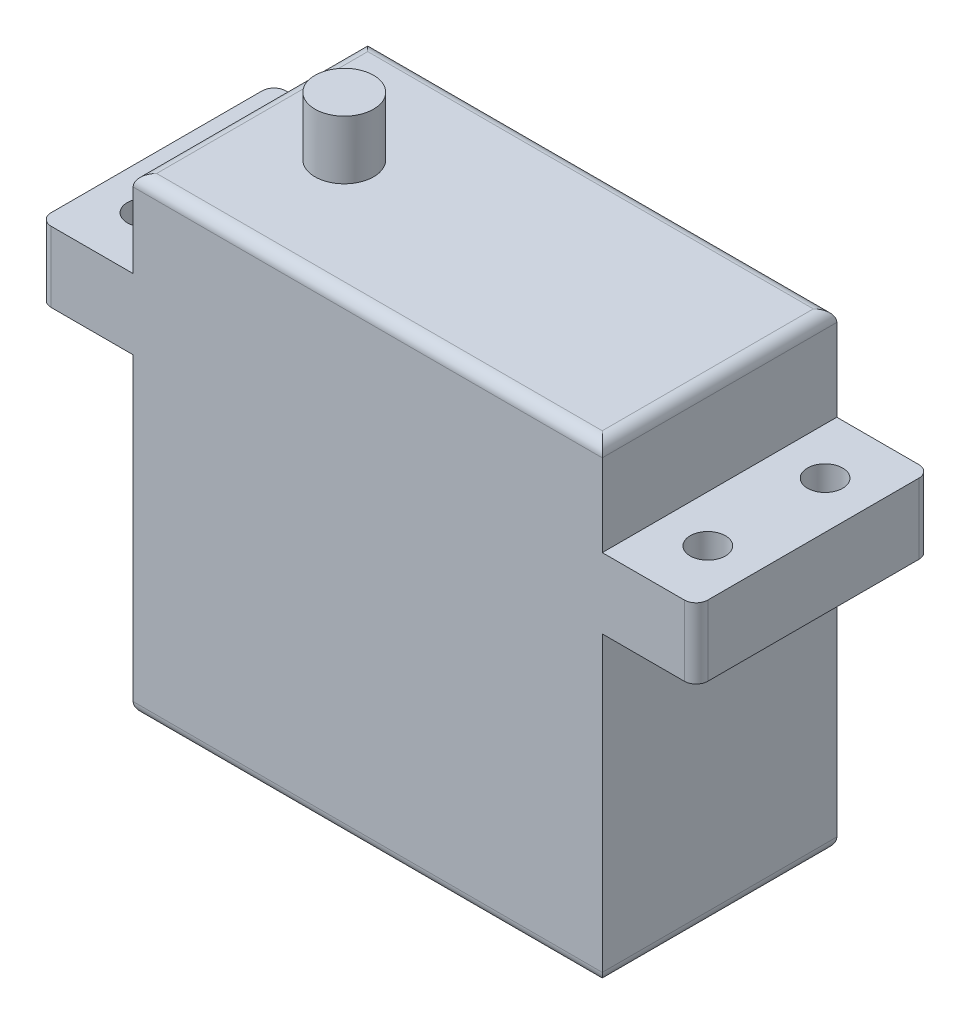
ISO-10303-21;
HEADER;
FILE_DESCRIPTION(('STEP AP214'),'2;1');
FILE_NAME('part.step','',(''),(''),'','','');
FILE_SCHEMA(('AUTOMOTIVE_DESIGN { 1 0 10303 214 1 1 1 1 }'));
ENDSEC;
DATA;
#1=APPLICATION_CONTEXT('core data for automotive mechanical design processes');
#2=APPLICATION_PROTOCOL_DEFINITION('international standard','automotive_design',2000,#1);
#3=PRODUCT_CONTEXT('',#1,'mechanical');
#4=PRODUCT('Part','Part','',(#3));
#5=PRODUCT_RELATED_PRODUCT_CATEGORY('part','',(#4));
#6=PRODUCT_DEFINITION_FORMATION('','',#4);
#7=PRODUCT_DEFINITION_CONTEXT('part definition',#1,'design');
#8=PRODUCT_DEFINITION('design','',#6,#7);
#9=PRODUCT_DEFINITION_SHAPE('','',#8);
#10=(LENGTH_UNIT() NAMED_UNIT(*) SI_UNIT(.MILLI.,.METRE.));
#11=(NAMED_UNIT(*) PLANE_ANGLE_UNIT() SI_UNIT($,.RADIAN.));
#12=(NAMED_UNIT(*) SI_UNIT($,.STERADIAN.) SOLID_ANGLE_UNIT());
#13=UNCERTAINTY_MEASURE_WITH_UNIT(LENGTH_MEASURE(1.E-05),#10,'distance_accuracy_value','');
#14=(GEOMETRIC_REPRESENTATION_CONTEXT(3) GLOBAL_UNCERTAINTY_ASSIGNED_CONTEXT((#13)) GLOBAL_UNIT_ASSIGNED_CONTEXT((#10,
#11,#12)) REPRESENTATION_CONTEXT('',''));
#15=CARTESIAN_POINT('',(0.,0.,0.));
#16=DIRECTION('',(0.,0.,1.));
#17=DIRECTION('',(1.,0.,0.));
#18=AXIS2_PLACEMENT_3D('',#15,#16,#17);
#19=CARTESIAN_POINT('',(-27.,0.,1.));
#20=DIRECTION('',(0.,-1.,0.));
#21=DIRECTION('',(1.,0.,0.));
#22=AXIS2_PLACEMENT_3D('',#19,#20,#21);
#23=CYLINDRICAL_SURFACE('',#22,1.);
#24=DIRECTION('',(0.,1.,0.));
#25=VECTOR('',#24,1.);
#26=CARTESIAN_POINT('',(-27.,0.,0.));
#27=LINE('',#26,#25);
#28=CARTESIAN_POINT('',(-27.,6.60422946958976,0.));
#29=VERTEX_POINT('',#28);
#30=CARTESIAN_POINT('',(-27.,12.6042294695898,0.));
#31=VERTEX_POINT('',#30);
#32=EDGE_CURVE('E322',#29,#31,#27,.T.);
#33=ORIENTED_EDGE('',*,*,#32,.F.);
#34=CARTESIAN_POINT('',(-27.,6.60422946958976,1.));
#35=DIRECTION('',(0.,1.,0.));
#36=DIRECTION('',(-1.,0.,0.));
#37=AXIS2_PLACEMENT_3D('',#34,#35,#36);
#38=CIRCLE('',#37,1.);
#39=CARTESIAN_POINT('',(-28.,6.60422946958976,1.));
#40=VERTEX_POINT('',#39);
#41=EDGE_CURVE('E328',#40,#29,#38,.F.);
#42=ORIENTED_EDGE('',*,*,#41,.F.);
#43=DIRECTION('',(0.,1.,0.));
#44=VECTOR('',#43,1.);
#45=CARTESIAN_POINT('',(-28.,0.,1.));
#46=LINE('',#45,#44);
#47=CARTESIAN_POINT('',(-28.,12.6042294695898,1.));
#48=VERTEX_POINT('',#47);
#49=EDGE_CURVE('E325',#48,#40,#46,.F.);
#50=ORIENTED_EDGE('',*,*,#49,.F.);
#51=CARTESIAN_POINT('',(-27.,12.6042294695898,1.));
#52=DIRECTION('',(0.,-1.,0.));
#53=DIRECTION('',(1.,0.,0.));
#54=AXIS2_PLACEMENT_3D('',#51,#52,#53);
#55=CIRCLE('',#54,1.);
#56=EDGE_CURVE('E330',#31,#48,#55,.F.);
#57=ORIENTED_EDGE('',*,*,#56,.F.);
#58=EDGE_LOOP('',(#33,#42,#50,#57));
#59=FACE_BOUND('',#58,.T.);
#60=ADVANCED_FACE('F40',(#59),#23,.T.);
#61=CARTESIAN_POINT('',(27.,0.,19.));
#62=DIRECTION('',(0.,-1.,0.));
#63=DIRECTION('',(0.,0.,-1.));
#64=AXIS2_PLACEMENT_3D('',#61,#62,#63);
#65=CYLINDRICAL_SURFACE('',#64,1.);
#66=DIRECTION('',(0.,-1.,0.));
#67=VECTOR('',#66,1.);
#68=CARTESIAN_POINT('',(28.,0.,19.));
#69=LINE('',#68,#67);
#70=CARTESIAN_POINT('',(28.,12.,19.));
#71=VERTEX_POINT('',#70);
#72=CARTESIAN_POINT('',(28.,6.,19.));
#73=VERTEX_POINT('',#72);
#74=EDGE_CURVE('E302',#71,#73,#69,.T.);
#75=ORIENTED_EDGE('',*,*,#74,.F.);
#76=CARTESIAN_POINT('',(27.,12.,19.));
#77=DIRECTION('',(0.,-1.,0.));
#78=DIRECTION('',(1.,0.,0.));
#79=AXIS2_PLACEMENT_3D('',#76,#77,#78);
#80=CIRCLE('',#79,1.);
#81=CARTESIAN_POINT('',(27.,12.,20.));
#82=VERTEX_POINT('',#81);
#83=EDGE_CURVE('E317',#82,#71,#80,.F.);
#84=ORIENTED_EDGE('',*,*,#83,.F.);
#85=DIRECTION('',(0.,-1.,0.));
#86=VECTOR('',#85,1.);
#87=CARTESIAN_POINT('',(27.,0.,20.));
#88=LINE('',#87,#86);
#89=CARTESIAN_POINT('',(27.,6.,20.));
#90=VERTEX_POINT('',#89);
#91=EDGE_CURVE('E314',#90,#82,#88,.F.);
#92=ORIENTED_EDGE('',*,*,#91,.F.);
#93=CARTESIAN_POINT('',(27.,6.,19.));
#94=DIRECTION('',(0.,1.,0.));
#95=DIRECTION('',(-1.,0.,0.));
#96=AXIS2_PLACEMENT_3D('',#93,#94,#95);
#97=CIRCLE('',#96,1.);
#98=EDGE_CURVE('E320',#73,#90,#97,.F.);
#99=ORIENTED_EDGE('',*,*,#98,.F.);
#100=EDGE_LOOP('',(#75,#84,#92,#99));
#101=FACE_BOUND('',#100,.T.);
#102=ADVANCED_FACE('F396',(#101),#65,.T.);
#103=CARTESIAN_POINT('',(-20.,20.,20.));
#104=DIRECTION('',(1.,0.,0.));
#105=DIRECTION('',(0.,1.,0.));
#106=AXIS2_PLACEMENT_3D('',#103,#104,#105);
#107=PLANE('',#106);
#108=DIRECTION('',(0.,-1.,0.));
#109=VECTOR('',#108,1.);
#110=CARTESIAN_POINT('',(-20.,20.,20.));
#111=LINE('',#110,#109);
#112=CARTESIAN_POINT('',(-20.,19.,20.));
#113=VERTEX_POINT('',#112);
#114=CARTESIAN_POINT('',(-20.,12.6042294695898,20.));
#115=VERTEX_POINT('',#114);
#116=EDGE_CURVE('E192',#113,#115,#111,.T.);
#117=ORIENTED_EDGE('',*,*,#116,.F.);
#118=DIRECTION('',(0.,0.,-1.));
#119=VECTOR('',#118,1.);
#120=CARTESIAN_POINT('',(-20.,19.,20.));
#121=LINE('',#120,#119);
#122=CARTESIAN_POINT('',(-20.,19.,0.));
#123=VERTEX_POINT('',#122);
#124=EDGE_CURVE('E268',#113,#123,#121,.T.);
#125=ORIENTED_EDGE('',*,*,#124,.T.);
#126=DIRECTION('',(0.,-1.,0.));
#127=VECTOR('',#126,1.);
#128=CARTESIAN_POINT('',(-20.,20.,0.));
#129=LINE('',#128,#127);
#130=CARTESIAN_POINT('',(-20.,12.6042294695898,0.));
#131=VERTEX_POINT('',#130);
#132=EDGE_CURVE('E243',#123,#131,#129,.T.);
#133=ORIENTED_EDGE('',*,*,#132,.T.);
#134=DIRECTION('',(0.,0.,-1.));
#135=VECTOR('',#134,1.);
#136=CARTESIAN_POINT('',(-20.,12.6042294695898,0.));
#137=LINE('',#136,#135);
#138=EDGE_CURVE('E197',#115,#131,#137,.T.);
#139=ORIENTED_EDGE('',*,*,#138,.F.);
#140=EDGE_LOOP('',(#117,#125,#133,#139));
#141=FACE_BOUND('',#140,.T.);
#142=ADVANCED_FACE('F402',(#141),#107,.F.);
#143=CARTESIAN_POINT('',(-20.,6.60422946958976,0.));
#144=VERTEX_POINT('',#143);
#145=CARTESIAN_POINT('',(-20.,-19.,0.));
#146=VERTEX_POINT('',#145);
#147=EDGE_CURVE('E242',#144,#146,#129,.T.);
#148=ORIENTED_EDGE('',*,*,#147,.T.);
#149=DIRECTION('',(0.,0.,-1.));
#150=VECTOR('',#149,1.);
#151=CARTESIAN_POINT('',(-20.,-19.,20.));
#152=LINE('',#151,#150);
#153=CARTESIAN_POINT('',(-20.,-19.,20.));
#154=VERTEX_POINT('',#153);
#155=EDGE_CURVE('E191',#146,#154,#152,.F.);
#156=ORIENTED_EDGE('',*,*,#155,.T.);
#157=CARTESIAN_POINT('',(-20.,6.60422946958976,20.));
#158=VERTEX_POINT('',#157);
#159=EDGE_CURVE('E176',#158,#154,#111,.T.);
#160=ORIENTED_EDGE('',*,*,#159,.F.);
#161=DIRECTION('',(0.,0.,1.));
#162=VECTOR('',#161,1.);
#163=CARTESIAN_POINT('',(-20.,6.60422946958976,0.));
#164=LINE('',#163,#162);
#165=EDGE_CURVE('E188',#144,#158,#164,.T.);
#166=ORIENTED_EDGE('',*,*,#165,.F.);
#167=EDGE_LOOP('',(#148,#156,#160,#166));
#168=FACE_BOUND('',#167,.T.);
#169=ADVANCED_FACE('F187',(#168),#107,.F.);
#170=CARTESIAN_POINT('',(20.,20.,20.));
#171=DIRECTION('',(-1.,0.,0.));
#172=DIRECTION('',(0.,-1.,0.));
#173=AXIS2_PLACEMENT_3D('',#170,#171,#172);
#174=PLANE('',#173);
#175=DIRECTION('',(0.,1.,0.));
#176=VECTOR('',#175,1.);
#177=CARTESIAN_POINT('',(20.,20.,0.));
#178=LINE('',#177,#176);
#179=CARTESIAN_POINT('',(20.,12.,0.));
#180=VERTEX_POINT('',#179);
#181=CARTESIAN_POINT('',(20.,19.,0.));
#182=VERTEX_POINT('',#181);
#183=EDGE_CURVE('E233',#180,#182,#178,.T.);
#184=ORIENTED_EDGE('',*,*,#183,.T.);
#185=DIRECTION('',(0.,0.,-1.));
#186=VECTOR('',#185,1.);
#187=CARTESIAN_POINT('',(20.,19.,20.));
#188=LINE('',#187,#186);
#189=CARTESIAN_POINT('',(20.,19.,20.));
#190=VERTEX_POINT('',#189);
#191=EDGE_CURVE('E265',#182,#190,#188,.F.);
#192=ORIENTED_EDGE('',*,*,#191,.T.);
#193=DIRECTION('',(0.,1.,0.));
#194=VECTOR('',#193,1.);
#195=CARTESIAN_POINT('',(20.,20.,20.));
#196=LINE('',#195,#194);
#197=CARTESIAN_POINT('',(20.,12.,20.));
#198=VERTEX_POINT('',#197);
#199=EDGE_CURVE('E235',#198,#190,#196,.T.);
#200=ORIENTED_EDGE('',*,*,#199,.F.);
#201=DIRECTION('',(0.,0.,1.));
#202=VECTOR('',#201,1.);
#203=CARTESIAN_POINT('',(20.,12.,20.));
#204=LINE('',#203,#202);
#205=EDGE_CURVE('E219',#180,#198,#204,.T.);
#206=ORIENTED_EDGE('',*,*,#205,.F.);
#207=EDGE_LOOP('',(#184,#192,#200,#206));
#208=FACE_BOUND('',#207,.T.);
#209=ADVANCED_FACE('F470',(#208),#174,.F.);
#210=CARTESIAN_POINT('',(20.,-19.,20.));
#211=VERTEX_POINT('',#210);
#212=CARTESIAN_POINT('',(20.,6.,20.));
#213=VERTEX_POINT('',#212);
#214=EDGE_CURVE('E193',#211,#213,#196,.T.);
#215=ORIENTED_EDGE('',*,*,#214,.F.);
#216=DIRECTION('',(0.,0.,-1.));
#217=VECTOR('',#216,1.);
#218=CARTESIAN_POINT('',(20.,-19.,20.));
#219=LINE('',#218,#217);
#220=CARTESIAN_POINT('',(20.,-19.,0.));
#221=VERTEX_POINT('',#220);
#222=EDGE_CURVE('E298',#211,#221,#219,.T.);
#223=ORIENTED_EDGE('',*,*,#222,.T.);
#224=CARTESIAN_POINT('',(20.,6.,0.));
#225=VERTEX_POINT('',#224);
#226=EDGE_CURVE('E239',#221,#225,#178,.T.);
#227=ORIENTED_EDGE('',*,*,#226,.T.);
#228=DIRECTION('',(0.,0.,-1.));
#229=VECTOR('',#228,1.);
#230=CARTESIAN_POINT('',(20.,6.,20.));
#231=LINE('',#230,#229);
#232=EDGE_CURVE('E214',#213,#225,#231,.T.);
#233=ORIENTED_EDGE('',*,*,#232,.F.);
#234=EDGE_LOOP('',(#215,#223,#227,#233));
#235=FACE_BOUND('',#234,.T.);
#236=ADVANCED_FACE('F434',(#235),#174,.F.);
#237=CARTESIAN_POINT('',(-20.,20.,20.));
#238=DIRECTION('',(0.,-1.,0.));
#239=DIRECTION('',(0.,0.,-1.));
#240=AXIS2_PLACEMENT_3D('',#237,#238,#239);
#241=PLANE('',#240);
#242=DIRECTION('',(0.,0.,-1.));
#243=VECTOR('',#242,1.);
#244=CARTESIAN_POINT('',(19.,20.,20.));
#245=LINE('',#244,#243);
#246=CARTESIAN_POINT('',(19.,20.,19.));
#247=VERTEX_POINT('',#246);
#248=CARTESIAN_POINT('',(19.,20.,1.));
#249=VERTEX_POINT('',#248);
#250=EDGE_CURVE('E260',#247,#249,#245,.T.);
#251=ORIENTED_EDGE('',*,*,#250,.T.);
#252=DIRECTION('',(-1.,0.,0.));
#253=VECTOR('',#252,1.);
#254=CARTESIAN_POINT('',(-20.,20.,1.));
#255=LINE('',#254,#253);
#256=CARTESIAN_POINT('',(-19.,20.,1.));
#257=VERTEX_POINT('',#256);
#258=EDGE_CURVE('E263',#249,#257,#255,.T.);
#259=ORIENTED_EDGE('',*,*,#258,.T.);
#260=DIRECTION('',(0.,0.,-1.));
#261=VECTOR('',#260,1.);
#262=CARTESIAN_POINT('',(-19.,20.,20.));
#263=LINE('',#262,#261);
#264=CARTESIAN_POINT('',(-19.,20.,19.));
#265=VERTEX_POINT('',#264);
#266=EDGE_CURVE('E258',#257,#265,#263,.F.);
#267=ORIENTED_EDGE('',*,*,#266,.T.);
#268=DIRECTION('',(-1.,0.,0.));
#269=VECTOR('',#268,1.);
#270=CARTESIAN_POINT('',(20.,20.,19.));
#271=LINE('',#270,#269);
#272=EDGE_CURVE('E248',#265,#247,#271,.F.);
#273=ORIENTED_EDGE('',*,*,#272,.T.);
#274=EDGE_LOOP('',(#251,#259,#267,#273));
#275=FACE_BOUND('',#274,.T.);
#276=CARTESIAN_POINT('',(-12.,20.,10.));
#277=DIRECTION('',(0.,-1.,0.));
#278=DIRECTION('',(0.,0.,-1.));
#279=AXIS2_PLACEMENT_3D('',#276,#277,#278);
#280=CIRCLE('',#279,2.5);
#281=CARTESIAN_POINT('',(-12.,20.,7.5));
#282=VERTEX_POINT('',#281);
#283=EDGE_CURVE('E238',#282,#282,#280,.F.);
#284=ORIENTED_EDGE('',*,*,#283,.F.);
#285=EDGE_LOOP('',(#284));
#286=FACE_BOUND('',#285,.T.);
#287=ADVANCED_FACE('F456',(#275,#286),#241,.F.);
#288=CARTESIAN_POINT('',(-20.,-20.,20.));
#289=DIRECTION('',(0.,1.,0.));
#290=DIRECTION('',(0.,0.,1.));
#291=AXIS2_PLACEMENT_3D('',#288,#289,#290);
#292=PLANE('',#291);
#293=DIRECTION('',(1.,0.,0.));
#294=VECTOR('',#293,1.);
#295=CARTESIAN_POINT('',(-20.,-20.,19.));
#296=LINE('',#295,#294);
#297=CARTESIAN_POINT('',(19.,-20.,19.));
#298=VERTEX_POINT('',#297);
#299=CARTESIAN_POINT('',(-19.,-20.,19.));
#300=VERTEX_POINT('',#299);
#301=EDGE_CURVE('E290',#298,#300,#296,.F.);
#302=ORIENTED_EDGE('',*,*,#301,.T.);
#303=DIRECTION('',(0.,0.,-1.));
#304=VECTOR('',#303,1.);
#305=CARTESIAN_POINT('',(-19.,-20.,20.));
#306=LINE('',#305,#304);
#307=CARTESIAN_POINT('',(-19.,-20.,1.));
#308=VERTEX_POINT('',#307);
#309=EDGE_CURVE('E292',#300,#308,#306,.T.);
#310=ORIENTED_EDGE('',*,*,#309,.T.);
#311=DIRECTION('',(1.,0.,0.));
#312=VECTOR('',#311,1.);
#313=CARTESIAN_POINT('',(-20.,-20.,1.));
#314=LINE('',#313,#312);
#315=CARTESIAN_POINT('',(19.,-20.,1.));
#316=VERTEX_POINT('',#315);
#317=EDGE_CURVE('E274',#308,#316,#314,.T.);
#318=ORIENTED_EDGE('',*,*,#317,.T.);
#319=DIRECTION('',(0.,0.,-1.));
#320=VECTOR('',#319,1.);
#321=CARTESIAN_POINT('',(19.,-20.,20.));
#322=LINE('',#321,#320);
#323=EDGE_CURVE('E288',#316,#298,#322,.F.);
#324=ORIENTED_EDGE('',*,*,#323,.T.);
#325=EDGE_LOOP('',(#302,#310,#318,#324));
#326=FACE_BOUND('',#325,.T.);
#327=ADVANCED_FACE('F454',(#326),#292,.F.);
#328=CARTESIAN_POINT('',(0.,0.,20.));
#329=DIRECTION('',(0.,0.,1.));
#330=DIRECTION('',(1.,0.,0.));
#331=AXIS2_PLACEMENT_3D('',#328,#329,#330);
#332=PLANE('',#331);
#333=DIRECTION('',(1.,0.,0.));
#334=VECTOR('',#333,1.);
#335=CARTESIAN_POINT('',(-28.,12.6042294695898,20.));
#336=LINE('',#335,#334);
#337=CARTESIAN_POINT('',(-27.,12.6042294695898,20.));
#338=VERTEX_POINT('',#337);
#339=EDGE_CURVE('E181',#338,#115,#336,.T.);
#340=ORIENTED_EDGE('',*,*,#339,.F.);
#341=DIRECTION('',(0.,1.,0.));
#342=VECTOR('',#341,1.);
#343=CARTESIAN_POINT('',(-27.,0.,20.));
#344=LINE('',#343,#342);
#345=CARTESIAN_POINT('',(-27.,6.60422946958976,20.));
#346=VERTEX_POINT('',#345);
#347=EDGE_CURVE('E48',#338,#346,#344,.F.);
#348=ORIENTED_EDGE('',*,*,#347,.T.);
#349=DIRECTION('',(1.,0.,0.));
#350=VECTOR('',#349,1.);
#351=CARTESIAN_POINT('',(-28.,6.60422946958976,20.));
#352=LINE('',#351,#350);
#353=EDGE_CURVE('E173',#346,#158,#352,.T.);
#354=ORIENTED_EDGE('',*,*,#353,.T.);
#355=ORIENTED_EDGE('',*,*,#159,.T.);
#356=DIRECTION('',(1.,0.,0.));
#357=VECTOR('',#356,1.);
#358=CARTESIAN_POINT('',(20.,-19.,20.));
#359=LINE('',#358,#357);
#360=EDGE_CURVE('E296',#154,#211,#359,.T.);
#361=ORIENTED_EDGE('',*,*,#360,.T.);
#362=ORIENTED_EDGE('',*,*,#214,.T.);
#363=DIRECTION('',(-1.,0.,0.));
#364=VECTOR('',#363,1.);
#365=CARTESIAN_POINT('',(28.,6.,20.));
#366=LINE('',#365,#364);
#367=EDGE_CURVE('E231',#90,#213,#366,.T.);
#368=ORIENTED_EDGE('',*,*,#367,.F.);
#369=ORIENTED_EDGE('',*,*,#91,.T.);
#370=DIRECTION('',(-1.,0.,0.));
#371=VECTOR('',#370,1.);
#372=CARTESIAN_POINT('',(28.,12.,20.));
#373=LINE('',#372,#371);
#374=EDGE_CURVE('E221',#82,#198,#373,.T.);
#375=ORIENTED_EDGE('',*,*,#374,.T.);
#376=ORIENTED_EDGE('',*,*,#199,.T.);
#377=DIRECTION('',(-1.,0.,0.));
#378=VECTOR('',#377,1.);
#379=CARTESIAN_POINT('',(-20.,19.,20.));
#380=LINE('',#379,#378);
#381=EDGE_CURVE('E272',#190,#113,#380,.T.);
#382=ORIENTED_EDGE('',*,*,#381,.T.);
#383=ORIENTED_EDGE('',*,*,#116,.T.);
#384=EDGE_LOOP('',(#340,#348,#354,#355,#361,#362,#368,#369,#375,#376,#382,#383));
#385=FACE_BOUND('',#384,.T.);
#386=ADVANCED_FACE('F175',(#385),#332,.T.);
#387=CARTESIAN_POINT('',(0.,0.,0.));
#388=DIRECTION('',(0.,0.,1.));
#389=DIRECTION('',(1.,0.,0.));
#390=AXIS2_PLACEMENT_3D('',#387,#388,#389);
#391=PLANE('',#390);
#392=DIRECTION('',(-1.,0.,0.));
#393=VECTOR('',#392,1.);
#394=CARTESIAN_POINT('',(28.,12.,0.));
#395=LINE('',#394,#393);
#396=CARTESIAN_POINT('',(27.,12.,0.));
#397=VERTEX_POINT('',#396);
#398=EDGE_CURVE('E227',#397,#180,#395,.T.);
#399=ORIENTED_EDGE('',*,*,#398,.F.);
#400=DIRECTION('',(0.,1.,0.));
#401=VECTOR('',#400,1.);
#402=CARTESIAN_POINT('',(27.,6.,0.));
#403=LINE('',#402,#401);
#404=CARTESIAN_POINT('',(27.,6.,0.));
#405=VERTEX_POINT('',#404);
#406=EDGE_CURVE('E338',#397,#405,#403,.F.);
#407=ORIENTED_EDGE('',*,*,#406,.T.);
#408=DIRECTION('',(-1.,0.,0.));
#409=VECTOR('',#408,1.);
#410=CARTESIAN_POINT('',(28.,6.,0.));
#411=LINE('',#410,#409);
#412=EDGE_CURVE('E229',#405,#225,#411,.T.);
#413=ORIENTED_EDGE('',*,*,#412,.T.);
#414=ORIENTED_EDGE('',*,*,#226,.F.);
#415=DIRECTION('',(1.,0.,0.));
#416=VECTOR('',#415,1.);
#417=CARTESIAN_POINT('',(0.,-19.,0.));
#418=LINE('',#417,#416);
#419=EDGE_CURVE('E300',#221,#146,#418,.F.);
#420=ORIENTED_EDGE('',*,*,#419,.T.);
#421=ORIENTED_EDGE('',*,*,#147,.F.);
#422=DIRECTION('',(1.,0.,0.));
#423=VECTOR('',#422,1.);
#424=CARTESIAN_POINT('',(-28.,6.60422946958976,0.));
#425=LINE('',#424,#423);
#426=EDGE_CURVE('E180',#29,#144,#425,.T.);
#427=ORIENTED_EDGE('',*,*,#426,.F.);
#428=ORIENTED_EDGE('',*,*,#32,.T.);
#429=DIRECTION('',(1.,0.,0.));
#430=VECTOR('',#429,1.);
#431=CARTESIAN_POINT('',(-28.,12.6042294695898,0.));
#432=LINE('',#431,#430);
#433=EDGE_CURVE('E210',#31,#131,#432,.T.);
#434=ORIENTED_EDGE('',*,*,#433,.T.);
#435=ORIENTED_EDGE('',*,*,#132,.F.);
#436=DIRECTION('',(-1.,0.,0.));
#437=VECTOR('',#436,1.);
#438=CARTESIAN_POINT('',(0.,19.,0.));
#439=LINE('',#438,#437);
#440=EDGE_CURVE('E270',#123,#182,#439,.F.);
#441=ORIENTED_EDGE('',*,*,#440,.T.);
#442=ORIENTED_EDGE('',*,*,#183,.F.);
#443=EDGE_LOOP('',(#399,#407,#413,#414,#420,#421,#427,#428,#434,#435,#441,#442));
#444=FACE_BOUND('',#443,.T.);
#445=ADVANCED_FACE('F439',(#444),#391,.F.);
#446=CARTESIAN_POINT('',(28.,6.,20.));
#447=DIRECTION('',(0.,1.,0.));
#448=DIRECTION('',(-1.,0.,0.));
#449=AXIS2_PLACEMENT_3D('',#446,#447,#448);
#450=PLANE('',#449);
#451=CARTESIAN_POINT('',(24.,6.,5.00000000000001));
#452=DIRECTION('',(0.,1.,0.));
#453=DIRECTION('',(-1.,0.,0.));
#454=AXIS2_PLACEMENT_3D('',#451,#452,#453);
#455=CIRCLE('',#454,1.5);
#456=CARTESIAN_POINT('',(22.5,6.,5.00000000000001));
#457=VERTEX_POINT('',#456);
#458=EDGE_CURVE('E204',#457,#457,#455,.T.);
#459=ORIENTED_EDGE('',*,*,#458,.T.);
#460=EDGE_LOOP('',(#459));
#461=FACE_BOUND('',#460,.T.);
#462=CARTESIAN_POINT('',(24.,6.,15.));
#463=DIRECTION('',(0.,1.,0.));
#464=DIRECTION('',(-1.,0.,0.));
#465=AXIS2_PLACEMENT_3D('',#462,#463,#464);
#466=CIRCLE('',#465,1.5);
#467=CARTESIAN_POINT('',(22.5,6.,15.));
#468=VERTEX_POINT('',#467);
#469=EDGE_CURVE('E252',#468,#468,#466,.T.);
#470=ORIENTED_EDGE('',*,*,#469,.T.);
#471=EDGE_LOOP('',(#470));
#472=FACE_BOUND('',#471,.T.);
#473=ORIENTED_EDGE('',*,*,#412,.F.);
#474=CARTESIAN_POINT('',(27.,6.,1.));
#475=DIRECTION('',(0.,1.,0.));
#476=DIRECTION('',(-1.,0.,0.));
#477=AXIS2_PLACEMENT_3D('',#474,#475,#476);
#478=CIRCLE('',#477,1.);
#479=CARTESIAN_POINT('',(28.,6.,1.));
#480=VERTEX_POINT('',#479);
#481=EDGE_CURVE('E340',#405,#480,#478,.F.);
#482=ORIENTED_EDGE('',*,*,#481,.T.);
#483=DIRECTION('',(0.,0.,-1.));
#484=VECTOR('',#483,1.);
#485=CARTESIAN_POINT('',(28.,6.,20.));
#486=LINE('',#485,#484);
#487=EDGE_CURVE('E215',#73,#480,#486,.T.);
#488=ORIENTED_EDGE('',*,*,#487,.F.);
#489=ORIENTED_EDGE('',*,*,#98,.T.);
#490=ORIENTED_EDGE('',*,*,#367,.T.);
#491=ORIENTED_EDGE('',*,*,#232,.T.);
#492=EDGE_LOOP('',(#473,#482,#488,#489,#490,#491));
#493=FACE_BOUND('',#492,.T.);
#494=ADVANCED_FACE('F424',(#461,#472,#493),#450,.F.);
#495=CARTESIAN_POINT('',(28.,12.,20.));
#496=DIRECTION('',(0.,-1.,0.));
#497=DIRECTION('',(1.,0.,0.));
#498=AXIS2_PLACEMENT_3D('',#495,#496,#497);
#499=PLANE('',#498);
#500=CARTESIAN_POINT('',(24.,12.,5.00000000000001));
#501=DIRECTION('',(0.,-1.,0.));
#502=DIRECTION('',(1.,0.,0.));
#503=AXIS2_PLACEMENT_3D('',#500,#501,#502);
#504=CIRCLE('',#503,1.5);
#505=CARTESIAN_POINT('',(25.5,12.,5.00000000000001));
#506=VERTEX_POINT('',#505);
#507=EDGE_CURVE('E254',#506,#506,#504,.T.);
#508=ORIENTED_EDGE('',*,*,#507,.T.);
#509=EDGE_LOOP('',(#508));
#510=FACE_BOUND('',#509,.T.);
#511=CARTESIAN_POINT('',(24.,12.,15.));
#512=DIRECTION('',(0.,-1.,0.));
#513=DIRECTION('',(1.,0.,0.));
#514=AXIS2_PLACEMENT_3D('',#511,#512,#513);
#515=CIRCLE('',#514,1.5);
#516=CARTESIAN_POINT('',(25.5,12.,15.));
#517=VERTEX_POINT('',#516);
#518=EDGE_CURVE('E249',#517,#517,#515,.T.);
#519=ORIENTED_EDGE('',*,*,#518,.T.);
#520=EDGE_LOOP('',(#519));
#521=FACE_BOUND('',#520,.T.);
#522=DIRECTION('',(0.,0.,1.));
#523=VECTOR('',#522,1.);
#524=CARTESIAN_POINT('',(28.,12.,20.));
#525=LINE('',#524,#523);
#526=CARTESIAN_POINT('',(28.,12.,1.));
#527=VERTEX_POINT('',#526);
#528=EDGE_CURVE('E218',#527,#71,#525,.T.);
#529=ORIENTED_EDGE('',*,*,#528,.F.);
#530=CARTESIAN_POINT('',(27.,12.,1.));
#531=DIRECTION('',(0.,-1.,0.));
#532=DIRECTION('',(1.,0.,0.));
#533=AXIS2_PLACEMENT_3D('',#530,#531,#532);
#534=CIRCLE('',#533,1.);
#535=EDGE_CURVE('E336',#527,#397,#534,.F.);
#536=ORIENTED_EDGE('',*,*,#535,.T.);
#537=ORIENTED_EDGE('',*,*,#398,.T.);
#538=ORIENTED_EDGE('',*,*,#205,.T.);
#539=ORIENTED_EDGE('',*,*,#374,.F.);
#540=ORIENTED_EDGE('',*,*,#83,.T.);
#541=EDGE_LOOP('',(#529,#536,#537,#538,#539,#540));
#542=FACE_BOUND('',#541,.T.);
#543=ADVANCED_FACE('F392',(#510,#521,#542),#499,.F.);
#544=CARTESIAN_POINT('',(28.,0.,0.));
#545=DIRECTION('',(1.,0.,0.));
#546=DIRECTION('',(0.,0.,-1.));
#547=AXIS2_PLACEMENT_3D('',#544,#545,#546);
#548=PLANE('',#547);
#549=ORIENTED_EDGE('',*,*,#487,.T.);
#550=DIRECTION('',(0.,1.,0.));
#551=VECTOR('',#550,1.);
#552=CARTESIAN_POINT('',(28.,12.,1.));
#553=LINE('',#552,#551);
#554=EDGE_CURVE('E333',#480,#527,#553,.T.);
#555=ORIENTED_EDGE('',*,*,#554,.T.);
#556=ORIENTED_EDGE('',*,*,#528,.T.);
#557=ORIENTED_EDGE('',*,*,#74,.T.);
#558=EDGE_LOOP('',(#549,#555,#556,#557));
#559=FACE_BOUND('',#558,.T.);
#560=ADVANCED_FACE('F386',(#559),#548,.T.);
#561=CARTESIAN_POINT('',(-28.,6.60422946958976,0.));
#562=DIRECTION('',(0.,1.,0.));
#563=DIRECTION('',(-1.,0.,0.));
#564=AXIS2_PLACEMENT_3D('',#561,#562,#563);
#565=PLANE('',#564);
#566=CARTESIAN_POINT('',(-24.,6.60422946958976,15.));
#567=DIRECTION('',(0.,1.,0.));
#568=DIRECTION('',(-1.,0.,0.));
#569=AXIS2_PLACEMENT_3D('',#566,#567,#568);
#570=CIRCLE('',#569,1.5);
#571=CARTESIAN_POINT('',(-25.5,6.60422946958976,15.));
#572=VERTEX_POINT('',#571);
#573=EDGE_CURVE('E253',#572,#572,#570,.T.);
#574=ORIENTED_EDGE('',*,*,#573,.T.);
#575=EDGE_LOOP('',(#574));
#576=FACE_BOUND('',#575,.T.);
#577=CARTESIAN_POINT('',(-24.,6.60422946958976,5.));
#578=DIRECTION('',(0.,1.,0.));
#579=DIRECTION('',(-1.,0.,0.));
#580=AXIS2_PLACEMENT_3D('',#577,#578,#579);
#581=CIRCLE('',#580,1.5);
#582=CARTESIAN_POINT('',(-25.5,6.60422946958976,5.));
#583=VERTEX_POINT('',#582);
#584=EDGE_CURVE('E361',#583,#583,#581,.T.);
#585=ORIENTED_EDGE('',*,*,#584,.T.);
#586=EDGE_LOOP('',(#585));
#587=FACE_BOUND('',#586,.T.);
#588=ORIENTED_EDGE('',*,*,#353,.F.);
#589=CARTESIAN_POINT('',(-27.,6.60422946958976,19.));
#590=DIRECTION('',(0.,1.,0.));
#591=DIRECTION('',(-1.,0.,0.));
#592=AXIS2_PLACEMENT_3D('',#589,#590,#591);
#593=CIRCLE('',#592,1.);
#594=CARTESIAN_POINT('',(-28.,6.60422946958976,19.));
#595=VERTEX_POINT('',#594);
#596=EDGE_CURVE('E11',#346,#595,#593,.F.);
#597=ORIENTED_EDGE('',*,*,#596,.T.);
#598=DIRECTION('',(0.,0.,1.));
#599=VECTOR('',#598,1.);
#600=CARTESIAN_POINT('',(-28.,6.60422946958976,0.));
#601=LINE('',#600,#599);
#602=EDGE_CURVE('E201',#40,#595,#601,.T.);
#603=ORIENTED_EDGE('',*,*,#602,.F.);
#604=ORIENTED_EDGE('',*,*,#41,.T.);
#605=ORIENTED_EDGE('',*,*,#426,.T.);
#606=ORIENTED_EDGE('',*,*,#165,.T.);
#607=EDGE_LOOP('',(#588,#597,#603,#604,#605,#606));
#608=FACE_BOUND('',#607,.T.);
#609=ADVANCED_FACE('F195',(#576,#587,#608),#565,.F.);
#610=CARTESIAN_POINT('',(-28.,12.6042294695898,0.));
#611=DIRECTION('',(0.,-1.,0.));
#612=DIRECTION('',(1.,0.,0.));
#613=AXIS2_PLACEMENT_3D('',#610,#611,#612);
#614=PLANE('',#613);
#615=CARTESIAN_POINT('',(-24.,12.6042294695898,15.));
#616=DIRECTION('',(0.,1.,0.));
#617=DIRECTION('',(-1.,0.,0.));
#618=AXIS2_PLACEMENT_3D('',#615,#616,#617);
#619=CIRCLE('',#618,1.5);
#620=CARTESIAN_POINT('',(-25.5,12.6042294695898,15.));
#621=VERTEX_POINT('',#620);
#622=EDGE_CURVE('E286',#621,#621,#619,.T.);
#623=ORIENTED_EDGE('',*,*,#622,.F.);
#624=EDGE_LOOP('',(#623));
#625=FACE_BOUND('',#624,.T.);
#626=CARTESIAN_POINT('',(-24.,12.6042294695898,5.));
#627=DIRECTION('',(0.,1.,0.));
#628=DIRECTION('',(-1.,0.,0.));
#629=AXIS2_PLACEMENT_3D('',#626,#627,#628);
#630=CIRCLE('',#629,1.5);
#631=CARTESIAN_POINT('',(-25.5,12.6042294695898,5.));
#632=VERTEX_POINT('',#631);
#633=EDGE_CURVE('E364',#632,#632,#630,.T.);
#634=ORIENTED_EDGE('',*,*,#633,.F.);
#635=EDGE_LOOP('',(#634));
#636=FACE_BOUND('',#635,.T.);
#637=DIRECTION('',(0.,0.,-1.));
#638=VECTOR('',#637,1.);
#639=CARTESIAN_POINT('',(-28.,12.6042294695898,0.));
#640=LINE('',#639,#638);
#641=CARTESIAN_POINT('',(-28.,12.6042294695898,19.));
#642=VERTEX_POINT('',#641);
#643=EDGE_CURVE('E207',#642,#48,#640,.T.);
#644=ORIENTED_EDGE('',*,*,#643,.F.);
#645=CARTESIAN_POINT('',(-27.,12.6042294695898,19.));
#646=DIRECTION('',(0.,-1.,0.));
#647=DIRECTION('',(1.,0.,0.));
#648=AXIS2_PLACEMENT_3D('',#645,#646,#647);
#649=CIRCLE('',#648,1.);
#650=EDGE_CURVE('E62',#642,#338,#649,.F.);
#651=ORIENTED_EDGE('',*,*,#650,.T.);
#652=ORIENTED_EDGE('',*,*,#339,.T.);
#653=ORIENTED_EDGE('',*,*,#138,.T.);
#654=ORIENTED_EDGE('',*,*,#433,.F.);
#655=ORIENTED_EDGE('',*,*,#56,.T.);
#656=EDGE_LOOP('',(#644,#651,#652,#653,#654,#655));
#657=FACE_BOUND('',#656,.T.);
#658=ADVANCED_FACE('F351',(#625,#636,#657),#614,.F.);
#659=CARTESIAN_POINT('',(-28.,0.,0.));
#660=DIRECTION('',(-1.,0.,0.));
#661=DIRECTION('',(0.,-1.,0.));
#662=AXIS2_PLACEMENT_3D('',#659,#660,#661);
#663=PLANE('',#662);
#664=ORIENTED_EDGE('',*,*,#602,.T.);
#665=DIRECTION('',(0.,1.,0.));
#666=VECTOR('',#665,1.);
#667=CARTESIAN_POINT('',(-28.,0.,19.));
#668=LINE('',#667,#666);
#669=EDGE_CURVE('E342',#595,#642,#668,.T.);
#670=ORIENTED_EDGE('',*,*,#669,.T.);
#671=ORIENTED_EDGE('',*,*,#643,.T.);
#672=ORIENTED_EDGE('',*,*,#49,.T.);
#673=EDGE_LOOP('',(#664,#670,#671,#672));
#674=FACE_BOUND('',#673,.T.);
#675=ADVANCED_FACE('F348',(#674),#663,.T.);
#676=CARTESIAN_POINT('',(-12.,25.,10.));
#677=DIRECTION('',(0.,-1.,0.));
#678=DIRECTION('',(0.,0.,-1.));
#679=AXIS2_PLACEMENT_3D('',#676,#677,#678);
#680=CYLINDRICAL_SURFACE('',#679,2.5);
#681=CARTESIAN_POINT('',(-12.,25.,10.));
#682=DIRECTION('',(0.,1.,0.));
#683=DIRECTION('',(0.,0.,1.));
#684=AXIS2_PLACEMENT_3D('',#681,#682,#683);
#685=CIRCLE('',#684,2.5);
#686=CARTESIAN_POINT('',(-12.,25.,12.5));
#687=VERTEX_POINT('',#686);
#688=EDGE_CURVE('E198',#687,#687,#685,.T.);
#689=ORIENTED_EDGE('',*,*,#688,.F.);
#690=EDGE_LOOP('',(#689));
#691=FACE_BOUND('',#690,.T.);
#692=ORIENTED_EDGE('',*,*,#283,.T.);
#693=EDGE_LOOP('',(#692));
#694=FACE_BOUND('',#693,.T.);
#695=ADVANCED_FACE('F655',(#691,#694),#680,.T.);
#696=CARTESIAN_POINT('',(-12.,25.,10.));
#697=DIRECTION('',(0.,1.,0.));
#698=DIRECTION('',(0.,0.,1.));
#699=AXIS2_PLACEMENT_3D('',#696,#697,#698);
#700=PLANE('',#699);
#701=ORIENTED_EDGE('',*,*,#688,.T.);
#702=EDGE_LOOP('',(#701));
#703=FACE_BOUND('',#702,.T.);
#704=ADVANCED_FACE('F381',(#703),#700,.T.);
#705=CARTESIAN_POINT('',(-24.,-2.39577053041024,5.));
#706=DIRECTION('',(0.,1.,0.));
#707=DIRECTION('',(-1.,0.,0.));
#708=AXIS2_PLACEMENT_3D('',#705,#706,#707);
#709=CYLINDRICAL_SURFACE('',#708,1.5);
#710=ORIENTED_EDGE('',*,*,#633,.T.);
#711=EDGE_LOOP('',(#710));
#712=FACE_BOUND('',#711,.T.);
#713=ORIENTED_EDGE('',*,*,#584,.F.);
#714=EDGE_LOOP('',(#713));
#715=FACE_BOUND('',#714,.T.);
#716=ADVANCED_FACE('F378',(#712,#715),#709,.F.);
#717=CARTESIAN_POINT('',(-24.,-2.39577053041024,15.));
#718=DIRECTION('',(0.,1.,0.));
#719=DIRECTION('',(-1.,0.,0.));
#720=AXIS2_PLACEMENT_3D('',#717,#718,#719);
#721=CYLINDRICAL_SURFACE('',#720,1.5);
#722=ORIENTED_EDGE('',*,*,#622,.T.);
#723=EDGE_LOOP('',(#722));
#724=FACE_BOUND('',#723,.T.);
#725=ORIENTED_EDGE('',*,*,#573,.F.);
#726=EDGE_LOOP('',(#725));
#727=FACE_BOUND('',#726,.T.);
#728=ADVANCED_FACE('F370',(#724,#727),#721,.F.);
#729=CARTESIAN_POINT('',(24.,-2.39577053041023,15.));
#730=DIRECTION('',(0.,1.,0.));
#731=DIRECTION('',(-1.,0.,0.));
#732=AXIS2_PLACEMENT_3D('',#729,#730,#731);
#733=CYLINDRICAL_SURFACE('',#732,1.5);
#734=ORIENTED_EDGE('',*,*,#518,.F.);
#735=EDGE_LOOP('',(#734));
#736=FACE_BOUND('',#735,.T.);
#737=ORIENTED_EDGE('',*,*,#469,.F.);
#738=EDGE_LOOP('',(#737));
#739=FACE_BOUND('',#738,.T.);
#740=ADVANCED_FACE('F613',(#736,#739),#733,.F.);
#741=CARTESIAN_POINT('',(24.,-2.39577053041023,5.00000000000001));
#742=DIRECTION('',(0.,1.,0.));
#743=DIRECTION('',(-1.,0.,0.));
#744=AXIS2_PLACEMENT_3D('',#741,#742,#743);
#745=CYLINDRICAL_SURFACE('',#744,1.5);
#746=ORIENTED_EDGE('',*,*,#507,.F.);
#747=EDGE_LOOP('',(#746));
#748=FACE_BOUND('',#747,.T.);
#749=ORIENTED_EDGE('',*,*,#458,.F.);
#750=EDGE_LOOP('',(#749));
#751=FACE_BOUND('',#750,.T.);
#752=ADVANCED_FACE('F488',(#748,#751),#745,.F.);
#753=CARTESIAN_POINT('',(-19.,19.,20.));
#754=DIRECTION('',(0.,0.,-1.));
#755=DIRECTION('',(-1.,0.,0.));
#756=AXIS2_PLACEMENT_3D('',#753,#754,#755);
#757=CYLINDRICAL_SURFACE('',#756,1.);
#758=CARTESIAN_POINT('',(-19.,19.,1.));
#759=DIRECTION('',(-0.707106781186547,0.,0.707106781186547));
#760=DIRECTION('',(-0.707106781186547,0.,-0.707106781186547));
#761=AXIS2_PLACEMENT_3D('',#758,#759,#760);
#762=ELLIPSE('',#761,1.41421356237309,1.);
#763=EDGE_CURVE('E280',#123,#257,#762,.F.);
#764=ORIENTED_EDGE('',*,*,#763,.F.);
#765=ORIENTED_EDGE('',*,*,#124,.F.);
#766=CARTESIAN_POINT('',(-19.,19.,19.));
#767=DIRECTION('',(0.707106781186547,0.,0.707106781186547));
#768=DIRECTION('',(0.707106781186547,0.,-0.707106781186547));
#769=AXIS2_PLACEMENT_3D('',#766,#767,#768);
#770=ELLIPSE('',#769,1.41421356237309,1.);
#771=EDGE_CURVE('E283',#265,#113,#770,.T.);
#772=ORIENTED_EDGE('',*,*,#771,.F.);
#773=ORIENTED_EDGE('',*,*,#266,.F.);
#774=EDGE_LOOP('',(#764,#765,#772,#773));
#775=FACE_BOUND('',#774,.T.);
#776=ADVANCED_FACE('F485',(#775),#757,.T.);
#777=CARTESIAN_POINT('',(0.,19.,19.));
#778=DIRECTION('',(1.,0.,0.));
#779=DIRECTION('',(0.,0.,-1.));
#780=AXIS2_PLACEMENT_3D('',#777,#778,#779);
#781=CYLINDRICAL_SURFACE('',#780,1.);
#782=ORIENTED_EDGE('',*,*,#771,.T.);
#783=ORIENTED_EDGE('',*,*,#381,.F.);
#784=CARTESIAN_POINT('',(19.,19.,19.));
#785=DIRECTION('',(0.707106781186547,0.,-0.707106781186547));
#786=DIRECTION('',(0.707106781186547,0.,0.707106781186547));
#787=AXIS2_PLACEMENT_3D('',#784,#785,#786);
#788=ELLIPSE('',#787,1.41421356237309,1.);
#789=EDGE_CURVE('E277',#247,#190,#788,.T.);
#790=ORIENTED_EDGE('',*,*,#789,.F.);
#791=ORIENTED_EDGE('',*,*,#272,.F.);
#792=EDGE_LOOP('',(#782,#783,#790,#791));
#793=FACE_BOUND('',#792,.T.);
#794=ADVANCED_FACE('F481',(#793),#781,.T.);
#795=CARTESIAN_POINT('',(-20.,19.,1.));
#796=DIRECTION('',(-1.,0.,0.));
#797=DIRECTION('',(0.,0.,1.));
#798=AXIS2_PLACEMENT_3D('',#795,#796,#797);
#799=CYLINDRICAL_SURFACE('',#798,1.);
#800=ORIENTED_EDGE('',*,*,#763,.T.);
#801=ORIENTED_EDGE('',*,*,#258,.F.);
#802=CARTESIAN_POINT('',(19.,19.,1.));
#803=DIRECTION('',(-0.707106781186547,0.,-0.707106781186547));
#804=DIRECTION('',(-0.707106781186547,0.,0.707106781186547));
#805=AXIS2_PLACEMENT_3D('',#802,#803,#804);
#806=ELLIPSE('',#805,1.41421356237309,1.);
#807=EDGE_CURVE('E275',#182,#249,#806,.F.);
#808=ORIENTED_EDGE('',*,*,#807,.F.);
#809=ORIENTED_EDGE('',*,*,#440,.F.);
#810=EDGE_LOOP('',(#800,#801,#808,#809));
#811=FACE_BOUND('',#810,.T.);
#812=ADVANCED_FACE('F477',(#811),#799,.T.);
#813=CARTESIAN_POINT('',(19.,19.,20.));
#814=DIRECTION('',(0.,0.,-1.));
#815=DIRECTION('',(-1.,0.,0.));
#816=AXIS2_PLACEMENT_3D('',#813,#814,#815);
#817=CYLINDRICAL_SURFACE('',#816,1.);
#818=ORIENTED_EDGE('',*,*,#789,.T.);
#819=ORIENTED_EDGE('',*,*,#191,.F.);
#820=ORIENTED_EDGE('',*,*,#807,.T.);
#821=ORIENTED_EDGE('',*,*,#250,.F.);
#822=EDGE_LOOP('',(#818,#819,#820,#821));
#823=FACE_BOUND('',#822,.T.);
#824=ADVANCED_FACE('F474',(#823),#817,.T.);
#825=CARTESIAN_POINT('',(19.,-19.,20.));
#826=DIRECTION('',(0.,0.,-1.));
#827=DIRECTION('',(-1.,0.,0.));
#828=AXIS2_PLACEMENT_3D('',#825,#826,#827);
#829=CYLINDRICAL_SURFACE('',#828,1.);
#830=CARTESIAN_POINT('',(19.,-19.,1.));
#831=DIRECTION('',(0.707106781186547,0.,0.707106781186547));
#832=DIRECTION('',(0.707106781186547,0.,-0.707106781186547));
#833=AXIS2_PLACEMENT_3D('',#830,#831,#832);
#834=ELLIPSE('',#833,1.41421356237309,1.);
#835=EDGE_CURVE('E307',#221,#316,#834,.F.);
#836=ORIENTED_EDGE('',*,*,#835,.F.);
#837=ORIENTED_EDGE('',*,*,#222,.F.);
#838=CARTESIAN_POINT('',(19.,-19.,19.));
#839=DIRECTION('',(0.707106781186547,0.,-0.707106781186547));
#840=DIRECTION('',(-0.707106781186547,0.,-0.707106781186547));
#841=AXIS2_PLACEMENT_3D('',#838,#839,#840);
#842=ELLIPSE('',#841,1.41421356237309,1.);
#843=EDGE_CURVE('E278',#298,#211,#842,.F.);
#844=ORIENTED_EDGE('',*,*,#843,.F.);
#845=ORIENTED_EDGE('',*,*,#323,.F.);
#846=EDGE_LOOP('',(#836,#837,#844,#845));
#847=FACE_BOUND('',#846,.T.);
#848=ADVANCED_FACE('F443',(#847),#829,.T.);
#849=CARTESIAN_POINT('',(0.,-19.,19.));
#850=DIRECTION('',(-1.,0.,0.));
#851=DIRECTION('',(0.,0.,1.));
#852=AXIS2_PLACEMENT_3D('',#849,#850,#851);
#853=CYLINDRICAL_SURFACE('',#852,1.);
#854=ORIENTED_EDGE('',*,*,#843,.T.);
#855=ORIENTED_EDGE('',*,*,#360,.F.);
#856=CARTESIAN_POINT('',(-19.,-19.,19.));
#857=DIRECTION('',(-0.707106781186547,0.,-0.707106781186547));
#858=DIRECTION('',(-0.707106781186547,0.,0.707106781186547));
#859=AXIS2_PLACEMENT_3D('',#856,#857,#858);
#860=ELLIPSE('',#859,1.41421356237309,1.);
#861=EDGE_CURVE('E305',#300,#154,#860,.T.);
#862=ORIENTED_EDGE('',*,*,#861,.F.);
#863=ORIENTED_EDGE('',*,*,#301,.F.);
#864=EDGE_LOOP('',(#854,#855,#862,#863));
#865=FACE_BOUND('',#864,.T.);
#866=ADVANCED_FACE('F452',(#865),#853,.T.);
#867=CARTESIAN_POINT('',(-20.,-19.,1.));
#868=DIRECTION('',(1.,0.,0.));
#869=DIRECTION('',(0.,0.,-1.));
#870=AXIS2_PLACEMENT_3D('',#867,#868,#869);
#871=CYLINDRICAL_SURFACE('',#870,1.);
#872=ORIENTED_EDGE('',*,*,#835,.T.);
#873=ORIENTED_EDGE('',*,*,#317,.F.);
#874=CARTESIAN_POINT('',(-19.,-19.,1.));
#875=DIRECTION('',(0.707106781186547,0.,-0.707106781186547));
#876=DIRECTION('',(0.707106781186547,0.,0.707106781186547));
#877=AXIS2_PLACEMENT_3D('',#874,#875,#876);
#878=ELLIPSE('',#877,1.41421356237309,1.);
#879=EDGE_CURVE('E303',#146,#308,#878,.F.);
#880=ORIENTED_EDGE('',*,*,#879,.F.);
#881=ORIENTED_EDGE('',*,*,#419,.F.);
#882=EDGE_LOOP('',(#872,#873,#880,#881));
#883=FACE_BOUND('',#882,.T.);
#884=ADVANCED_FACE('F415',(#883),#871,.T.);
#885=CARTESIAN_POINT('',(-19.,-19.,20.));
#886=DIRECTION('',(0.,0.,-1.));
#887=DIRECTION('',(-1.,0.,0.));
#888=AXIS2_PLACEMENT_3D('',#885,#886,#887);
#889=CYLINDRICAL_SURFACE('',#888,1.);
#890=ORIENTED_EDGE('',*,*,#861,.T.);
#891=ORIENTED_EDGE('',*,*,#155,.F.);
#892=ORIENTED_EDGE('',*,*,#879,.T.);
#893=ORIENTED_EDGE('',*,*,#309,.F.);
#894=EDGE_LOOP('',(#890,#891,#892,#893));
#895=FACE_BOUND('',#894,.T.);
#896=ADVANCED_FACE('F409',(#895),#889,.T.);
#897=CARTESIAN_POINT('',(27.,0.,1.));
#898=DIRECTION('',(0.,-1.,0.));
#899=DIRECTION('',(0.,0.,-1.));
#900=AXIS2_PLACEMENT_3D('',#897,#898,#899);
#901=CYLINDRICAL_SURFACE('',#900,1.);
#902=ORIENTED_EDGE('',*,*,#481,.F.);
#903=ORIENTED_EDGE('',*,*,#406,.F.);
#904=ORIENTED_EDGE('',*,*,#535,.F.);
#905=ORIENTED_EDGE('',*,*,#554,.F.);
#906=EDGE_LOOP('',(#902,#903,#904,#905));
#907=FACE_BOUND('',#906,.T.);
#908=ADVANCED_FACE('F407',(#907),#901,.T.);
#909=CARTESIAN_POINT('',(-27.,0.,19.));
#910=DIRECTION('',(0.,1.,0.));
#911=DIRECTION('',(-1.,0.,0.));
#912=AXIS2_PLACEMENT_3D('',#909,#910,#911);
#913=CYLINDRICAL_SURFACE('',#912,1.);
#914=ORIENTED_EDGE('',*,*,#596,.F.);
#915=ORIENTED_EDGE('',*,*,#347,.F.);
#916=ORIENTED_EDGE('',*,*,#650,.F.);
#917=ORIENTED_EDGE('',*,*,#669,.F.);
#918=EDGE_LOOP('',(#914,#915,#916,#917));
#919=FACE_BOUND('',#918,.T.);
#920=ADVANCED_FACE('F42',(#919),#913,.T.);
#921=CLOSED_SHELL('',(#60,#102,#142,#169,#209,#236,#287,#327,#386,#445,#494,#543,#560,#609,#658,
#675,#695,#704,#716,#728,#740,#752,#776,#794,#812,#824,#848,#866,#884,#896,#908,#920));
#922=MANIFOLD_SOLID_BREP('B2',#921);
#923=ADVANCED_BREP_SHAPE_REPRESENTATION('',(#18,#922),#14);
#924=SHAPE_DEFINITION_REPRESENTATION(#9,#923);
ENDSEC;
END-ISO-10303-21;
